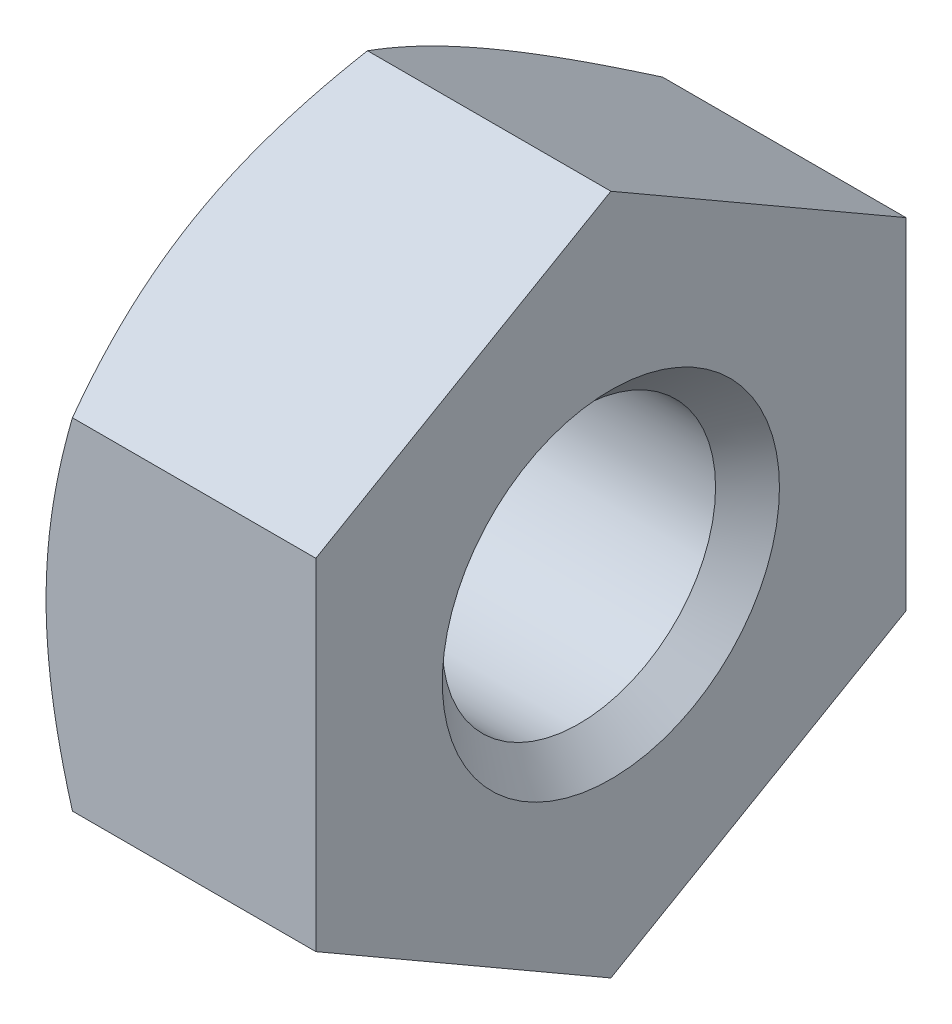
ISO-10303-21;
HEADER;
FILE_DESCRIPTION(('STEP AP214'),'2;1');
FILE_NAME('part.step','',(''),(''),'','','');
FILE_SCHEMA(('AUTOMOTIVE_DESIGN { 1 0 10303 214 1 1 1 1 }'));
ENDSEC;
DATA;
#1=APPLICATION_CONTEXT('core data for automotive mechanical design processes');
#2=APPLICATION_PROTOCOL_DEFINITION('international standard','automotive_design',2000,#1);
#3=PRODUCT_CONTEXT('',#1,'mechanical');
#4=PRODUCT('Part','Part','',(#3));
#5=PRODUCT_RELATED_PRODUCT_CATEGORY('part','',(#4));
#6=PRODUCT_DEFINITION_FORMATION('','',#4);
#7=PRODUCT_DEFINITION_CONTEXT('part definition',#1,'design');
#8=PRODUCT_DEFINITION('design','',#6,#7);
#9=PRODUCT_DEFINITION_SHAPE('','',#8);
#10=(LENGTH_UNIT() NAMED_UNIT(*) SI_UNIT(.MILLI.,.METRE.));
#11=(NAMED_UNIT(*) PLANE_ANGLE_UNIT() SI_UNIT($,.RADIAN.));
#12=(NAMED_UNIT(*) SI_UNIT($,.STERADIAN.) SOLID_ANGLE_UNIT());
#13=UNCERTAINTY_MEASURE_WITH_UNIT(LENGTH_MEASURE(1.E-05),#10,'distance_accuracy_value','');
#14=(GEOMETRIC_REPRESENTATION_CONTEXT(3) GLOBAL_UNCERTAINTY_ASSIGNED_CONTEXT((#13)) GLOBAL_UNIT_ASSIGNED_CONTEXT((#10,
#11,#12)) REPRESENTATION_CONTEXT('',''));
#15=CARTESIAN_POINT('',(0.,0.,0.));
#16=DIRECTION('',(0.,0.,1.));
#17=DIRECTION('',(1.,0.,0.));
#18=AXIS2_PLACEMENT_3D('',#15,#16,#17);
#19=CARTESIAN_POINT('',(1.6,-2.02072594216369,3.5));
#20=DIRECTION('',(0.,0.866025403784439,-0.5));
#21=DIRECTION('',(-1.,0.,0.));
#22=AXIS2_PLACEMENT_3D('',#19,#20,#21);
#23=PLANE('',#22);
#24=DIRECTION('',(-1.,0.,0.));
#25=VECTOR('',#24,1.);
#26=CARTESIAN_POINT('',(1.6,-4.04145188432738,0.));
#27=LINE('',#26,#25);
#28=CARTESIAN_POINT('',(1.6,-4.04145188432738,0.));
#29=VERTEX_POINT('',#28);
#30=CARTESIAN_POINT('',(-1.28739260883036,-4.04145188432738,0.));
#31=VERTEX_POINT('',#30);
#32=EDGE_CURVE('E10',#29,#31,#27,.T.);
#33=ORIENTED_EDGE('',*,*,#32,.F.);
#34=DIRECTION('',(0.,-0.5,-0.866025403784439));
#35=VECTOR('',#34,1.);
#36=CARTESIAN_POINT('',(1.6,-2.02072594216369,3.5));
#37=LINE('',#36,#35);
#38=CARTESIAN_POINT('',(1.6,-2.02072594216369,3.5));
#39=VERTEX_POINT('',#38);
#40=EDGE_CURVE('E308',#39,#29,#37,.T.);
#41=ORIENTED_EDGE('',*,*,#40,.F.);
#42=DIRECTION('',(-1.,0.,0.));
#43=VECTOR('',#42,1.);
#44=CARTESIAN_POINT('',(1.6,-2.02072594216369,3.5));
#45=LINE('',#44,#43);
#46=CARTESIAN_POINT('',(-1.28739260883036,-2.02072594216369,3.5));
#47=VERTEX_POINT('',#46);
#48=EDGE_CURVE('E172',#39,#47,#45,.T.);
#49=ORIENTED_EDGE('',*,*,#48,.T.);
#50=CARTESIAN_POINT('',(-1.6,-3.03108891324554,1.75000000000001));
#51=CARTESIAN_POINT('',(-1.60002957157327,-2.98866380957274,1.82342943247012));
#52=CARTESIAN_POINT('',(-1.59826342510537,-2.94622154089033,1.89684756011083));
#53=CARTESIAN_POINT('',(-1.59120796858002,-2.86156580187272,2.0433610894839));
#54=CARTESIAN_POINT('',(-1.58592893947825,-2.81935202521039,2.11645680823324));
#55=CARTESIAN_POINT('',(-1.57185336070191,-2.73479449103968,2.26310128564444));
#56=CARTESIAN_POINT('',(-1.56302605149659,-2.69245289723628,2.33664831811473));
#57=CARTESIAN_POINT('',(-1.5419161593019,-2.60711315357974,2.48483891661634));
#58=CARTESIAN_POINT('',(-1.52956839907359,-2.56411867715756,2.5594752295579));
#59=CARTESIAN_POINT('',(-1.50239590218583,-2.48005600904668,2.70509227694218));
#60=CARTESIAN_POINT('',(-1.48769793468568,-2.43898321621904,2.77609417229335));
#61=CARTESIAN_POINT('',(-1.45541959110542,-2.35655536943079,2.9186266827914));
#62=CARTESIAN_POINT('',(-1.43780242316147,-2.315204178394,2.9901511798518));
#63=CARTESIAN_POINT('',(-1.39971436888636,-2.23199323843653,3.13413905758833));
#64=CARTESIAN_POINT('',(-1.37919366198645,-2.1901397490043,3.20659279040999));
#65=CARTESIAN_POINT('',(-1.3353061551241,-2.10570692769486,3.35279662696808));
#66=CARTESIAN_POINT('',(-1.31188105391822,-2.06313558894262,3.42653388914834));
#67=CARTESIAN_POINT('',(-1.28739260883047,-2.02072594216354,3.49999999999987));
#68=B_SPLINE_CURVE_WITH_KNOTS('',3,(#50,#51,#52,#53,#54,#55,#56,#57,#58,#59,#60,#61,#62,#63,#64,
#65,#66,#67),.UNSPECIFIED.,.F.,.F.,(4,2,2,2,2,2,2,2,4),(0.,0.254391604140369,0.508041950028936,
0.763940282497238,1.02492381927395,1.27487521361346,1.52825714495415,1.78668233582199,
2.05156451629914),.UNSPECIFIED.);
#69=CARTESIAN_POINT('',(-1.6,-3.03108891324554,1.75));
#70=VERTEX_POINT('',#69);
#71=EDGE_CURVE('E163',#70,#47,#68,.T.);
#72=ORIENTED_EDGE('',*,*,#71,.F.);
#73=CARTESIAN_POINT('',(-1.28739260883058,-4.041451884327,-1.21301629162025E-13));
#74=CARTESIAN_POINT('',(-1.311881761801,-3.99903184403362,0.0734636657680727));
#75=CARTESIAN_POINT('',(-1.33530995552475,-3.95645377599351,0.147199864803283));
#76=CARTESIAN_POINT('',(-1.37920144505174,-3.87204819842292,0.293402513742193));
#77=CARTESIAN_POINT('',(-1.39972349504142,-3.83022798836153,0.365855583126786));
#78=CARTESIAN_POINT('',(-1.43781189146031,-3.74714453885451,0.509855310712891));
#79=CARTESIAN_POINT('',(-1.45542859350913,-3.70588660426272,0.581391622654936));
#80=CARTESIAN_POINT('',(-1.48770446842956,-3.62369124365301,0.723952727806153));
#81=CARTESIAN_POINT('',(-1.50240102319162,-3.58275722630122,0.794971002150564));
#82=CARTESIAN_POINT('',(-1.52957272990249,-3.49871633031337,0.940500975222592));
#83=CARTESIAN_POINT('',(-1.54192009347573,-3.45559374948824,1.01502763096098));
#84=CARTESIAN_POINT('',(-1.56302976692369,-3.36995186279489,1.16301658413272));
#85=CARTESIAN_POINT('',(-1.57185590547304,-3.32743671860256,1.23647210353567));
#86=CARTESIAN_POINT('',(-1.58593092819756,-3.24271490728029,1.38308302796878));
#87=CARTESIAN_POINT('',(-1.59120901673259,-3.20050862274593,1.45623583103307));
#88=CARTESIAN_POINT('',(-1.59826430036532,-3.11590624613429,1.60292982751019));
#89=CARTESIAN_POINT('',(-1.60002962326208,-3.07350999412018,1.67647149858659));
#90=CARTESIAN_POINT('',(-1.6,-3.03108891324554,1.75000000000001));
#91=B_SPLINE_CURVE_WITH_KNOTS('',3,(#73,#74,#75,#76,#77,#78,#79,#80,#81,#82,#83,#84,#85,#86,#87,
#88,#89,#90),.UNSPECIFIED.,.F.,.F.,(4,2,2,2,2,2,2,2,4),(0.,0.264891758241821,0.523267836488387,
0.776542750901293,1.02633037013731,1.2872217238541,1.54314190021481,1.79692889863092,
2.05157218165485),.UNSPECIFIED.);
#92=EDGE_CURVE('E129',#31,#70,#91,.T.);
#93=ORIENTED_EDGE('',*,*,#92,.F.);
#94=EDGE_LOOP('',(#33,#41,#49,#72,#93));
#95=FACE_BOUND('',#94,.T.);
#96=ADVANCED_FACE('F16',(#95),#23,.F.);
#97=CARTESIAN_POINT('',(1.6,-4.04145188432738,0.));
#98=DIRECTION('',(0.,0.866025403784439,0.5));
#99=DIRECTION('',(1.,0.,0.));
#100=AXIS2_PLACEMENT_3D('',#97,#98,#99);
#101=PLANE('',#100);
#102=DIRECTION('',(-1.,0.,0.));
#103=VECTOR('',#102,1.);
#104=CARTESIAN_POINT('',(1.6,-2.02072594216369,-3.5));
#105=LINE('',#104,#103);
#106=CARTESIAN_POINT('',(1.6,-2.02072594216369,-3.5));
#107=VERTEX_POINT('',#106);
#108=CARTESIAN_POINT('',(-1.28739260883036,-2.02072594216369,-3.5));
#109=VERTEX_POINT('',#108);
#110=EDGE_CURVE('E27',#107,#109,#105,.T.);
#111=ORIENTED_EDGE('',*,*,#110,.F.);
#112=DIRECTION('',(0.,0.5,-0.866025403784439));
#113=VECTOR('',#112,1.);
#114=CARTESIAN_POINT('',(1.6,-4.04145188432738,0.));
#115=LINE('',#114,#113);
#116=EDGE_CURVE('E304',#29,#107,#115,.T.);
#117=ORIENTED_EDGE('',*,*,#116,.F.);
#118=ORIENTED_EDGE('',*,*,#32,.T.);
#119=CARTESIAN_POINT('',(-1.6,-3.03108891324554,-1.75));
#120=CARTESIAN_POINT('',(-1.60002957157327,-3.0734681153142,-1.67654406622529));
#121=CARTESIAN_POINT('',(-1.59826342510538,-3.11582894460854,-1.60307891953086));
#122=CARTESIAN_POINT('',(-1.59120796858003,-3.20038551353537,-1.45650813427771));
#123=CARTESIAN_POINT('',(-1.58592893947827,-3.24258137454906,-1.38340207192345));
#124=CARTESIAN_POINT('',(-1.57185336070194,-3.32730045022633,-1.23685086054454));
#125=CARTESIAN_POINT('',(-1.56302605149664,-3.36982325181665,-1.16340844843916));
#126=CARTESIAN_POINT('',(-1.54191615930192,-3.45549020289232,-1.01540676323053));
#127=CARTESIAN_POINT('',(-1.52956839907358,-3.49862990773318,-0.940854297956689));
#128=CARTESIAN_POINT('',(-1.50239590218554,-3.58270663593703,-0.795245368170903));
#129=CARTESIAN_POINT('',(-1.48769793468507,-3.62365968461484,-0.724174338501541));
#130=CARTESIAN_POINT('',(-1.45541959110441,-3.705882536178,-0.581523473953656));
#131=CARTESIAN_POINT('',(-1.43780242316039,-3.74714897210693,-0.50995004350852));
#132=CARTESIAN_POINT('',(-1.39971436888529,-3.8302406620849,-0.365893316764168));
#133=CARTESIAN_POINT('',(-1.37919366198548,-3.8720606905911,-0.293420265268176));
#134=CARTESIAN_POINT('',(-1.33530615512352,-3.95646051652562,-0.147197378822947));
#135=CARTESIAN_POINT('',(-1.31188105391794,-3.99903318940255,-0.073460886901059));
#136=CARTESIAN_POINT('',(-1.28739260883047,-4.04145188432719,0.));
#137=B_SPLINE_CURVE_WITH_KNOTS('',3,(#119,#120,#121,#122,#123,#124,#125,#126,#127,#128,#129,
#130,#131,#132,#133,#134,#135,#136),.UNSPECIFIED.,.F.,.F.,(4,2,2,2,2,2,2,2,4),(0.,
0.254391604143219,0.508041950032736,0.763940282500101,1.024923819274,1.27487521361636,
1.52825714495812,1.78668233582506,2.05156451629917),.UNSPECIFIED.);
#138=CARTESIAN_POINT('',(-1.6,-3.03108891324554,-1.75));
#139=VERTEX_POINT('',#138);
#140=EDGE_CURVE('E135',#139,#31,#137,.T.);
#141=ORIENTED_EDGE('',*,*,#140,.F.);
#142=CARTESIAN_POINT('',(-1.28739260883058,-2.02072594216339,-3.49999999999974));
#143=CARTESIAN_POINT('',(-1.3118817618016,-2.0631373228281,-3.42653133459022));
#144=CARTESIAN_POINT('',(-1.33530995552598,-2.10570571035191,-3.35278954650395));
#145=CARTESIAN_POINT('',(-1.37920144505379,-2.19011812964922,-3.20659084763471));
#146=CARTESIAN_POINT('',(-1.39972349504369,-2.23195422328781,-3.13414694863699));
#147=CARTESIAN_POINT('',(-1.43781189146261,-2.3151199207615,-2.99019470693672));
#148=CARTESIAN_POINT('',(-1.45542859351127,-2.35644321689999,-2.9186961315021));
#149=CARTESIAN_POINT('',(-1.48770446843083,-2.4388070752467,-2.77623230856776));
#150=CARTESIAN_POINT('',(-1.50240102319223,-2.47984369628549,-2.70527327249189));
#151=CARTESIAN_POINT('',(-1.5295727299025,-2.56385590198499,-2.55972673507407));
#152=CARTESIAN_POINT('',(-1.54192009347568,-2.60683658870245,-2.48511815673209));
#153=CARTESIAN_POINT('',(-1.56302976692358,-2.69217783828367,-2.33695563063963));
#154=CARTESIAN_POINT('',(-1.57185590547298,-2.73453461203886,-2.26340867602139));
#155=CARTESIAN_POINT('',(-1.58593092819752,-2.81914249140874,-2.11673197294491));
#156=CARTESIAN_POINT('',(-1.59120901673257,-2.8613915349527,-2.0436038568071));
#157=CARTESIAN_POINT('',(-1.59826430036529,-2.94613107417696,-1.89698905120442));
#158=CARTESIAN_POINT('',(-1.60002962326207,-2.98862190355766,-1.82350198439841));
#159=CARTESIAN_POINT('',(-1.6,-3.03108891324554,-1.75));
#160=B_SPLINE_CURVE_WITH_KNOTS('',3,(#142,#143,#144,#145,#146,#147,#148,#149,#150,#151,#152,
#153,#154,#155,#156,#157,#158,#159),.UNSPECIFIED.,.F.,.F.,(4,2,2,2,2,2,2,2,4),(0.,
0.264891758248264,0.523267836496761,0.776542750907413,1.02633037013737,1.28722172386015,
1.54314190022287,1.79692889863695,2.05157218165483),.UNSPECIFIED.);
#161=EDGE_CURVE('E158',#109,#139,#160,.T.);
#162=ORIENTED_EDGE('',*,*,#161,.F.);
#163=EDGE_LOOP('',(#111,#117,#118,#141,#162));
#164=FACE_BOUND('',#163,.T.);
#165=ADVANCED_FACE('F518',(#164),#101,.F.);
#166=CARTESIAN_POINT('',(1.6,-2.02072594216369,-3.5));
#167=DIRECTION('',(0.,0.,1.));
#168=DIRECTION('',(1.,0.,0.));
#169=AXIS2_PLACEMENT_3D('',#166,#167,#168);
#170=PLANE('',#169);
#171=DIRECTION('',(-1.,0.,0.));
#172=VECTOR('',#171,1.);
#173=CARTESIAN_POINT('',(1.6,2.02072594216369,-3.5));
#174=LINE('',#173,#172);
#175=CARTESIAN_POINT('',(1.6,2.02072594216369,-3.5));
#176=VERTEX_POINT('',#175);
#177=CARTESIAN_POINT('',(-1.28739260883036,2.02072594216369,-3.5));
#178=VERTEX_POINT('',#177);
#179=EDGE_CURVE('E289',#176,#178,#174,.T.);
#180=ORIENTED_EDGE('',*,*,#179,.F.);
#181=DIRECTION('',(0.,1.,0.));
#182=VECTOR('',#181,1.);
#183=CARTESIAN_POINT('',(1.6,-2.02072594216369,-3.5));
#184=LINE('',#183,#182);
#185=EDGE_CURVE('E300',#107,#176,#184,.T.);
#186=ORIENTED_EDGE('',*,*,#185,.F.);
#187=ORIENTED_EDGE('',*,*,#110,.T.);
#188=CARTESIAN_POINT('',(-1.6,0.,-3.5));
#189=CARTESIAN_POINT('',(-1.60002985945304,-0.0850895445468611,-3.49997330807448));
#190=CARTESIAN_POINT('',(-1.59825603889534,-0.170178056856382,-3.49991852167455));
#191=CARTESIAN_POINT('',(-1.59116711521132,-0.339923824420759,-3.4998391138121));
#192=CARTESIAN_POINT('',(-1.5858638274263,-0.424581572101538,-3.49981439248102));
#193=CARTESIAN_POINT('',(-1.57172169737839,-0.594323012203998,-3.49988042440541));
#194=CARTESIAN_POINT('',(-1.56285321646093,-0.679404217565962,-3.49997215995854));
#195=CARTESIAN_POINT('',(-1.54164335661952,-0.850818568447764,-3.50014344890988));
#196=CARTESIAN_POINT('',(-1.52923745376652,-0.937143658980966,-3.50022272899293));
#197=CARTESIAN_POINT('',(-1.50200677589762,-1.10519935721461,-3.50023410680411));
#198=CARTESIAN_POINT('',(-1.48732501833766,-1.18695330123284,-3.50017302187236));
#199=CARTESIAN_POINT('',(-1.45509108540878,-1.35108654695151,-3.50007560756531));
#200=CARTESIAN_POINT('',(-1.43750144498095,-1.43345847341397,-3.5000396384291));
#201=CARTESIAN_POINT('',(-1.399480004769,-1.599293245139,-3.49999599501919));
#202=CARTESIAN_POINT('',(-1.37899794775457,-1.6827444918892,-3.49998890729803));
#203=CARTESIAN_POINT('',(-1.33519894620792,-1.85115371236418,-3.49998822891513));
#204=CARTESIAN_POINT('',(-1.31182346182259,-1.93609649918093,-3.49999498370794));
#205=CARTESIAN_POINT('',(-1.28739260883036,-2.02072594216368,-3.5));
#206=B_SPLINE_CURVE_WITH_KNOTS('',3,(#188,#189,#190,#191,#192,#193,#194,#195,#196,#197,#198,
#199,#200,#201,#202,#203,#204,#205),.UNSPECIFIED.,.F.,.F.,(4,2,2,2,2,2,2,2,4),(0.,
0.255247470218691,0.50964473643535,0.766202135105267,1.02777673514438,1.2769170751132,
1.52956127384764,1.78731159849954,2.05157262925042),.UNSPECIFIED.);
#207=CARTESIAN_POINT('',(-1.6,0.,-3.5));
#208=VERTEX_POINT('',#207);
#209=EDGE_CURVE('E583',#208,#109,#206,.T.);
#210=ORIENTED_EDGE('',*,*,#209,.F.);
#211=CARTESIAN_POINT('',(-1.28739260883036,2.02072594216369,-3.49999999999999));
#212=CARTESIAN_POINT('',(-1.31182815312882,1.93608005208965,-3.49999507400937));
#213=CARTESIAN_POINT('',(-1.33520833735885,1.85112080636164,-3.49998754450913));
#214=CARTESIAN_POINT('',(-1.37901586685387,1.68268058395045,-3.49998547850255));
#215=CARTESIAN_POINT('',(-1.39950180444946,1.59921480791501,-3.49999062621565));
#216=CARTESIAN_POINT('',(-1.43753001486371,1.43335271755952,-3.50002972849625));
#217=CARTESIAN_POINT('',(-1.45512260330846,1.35096801530384,-3.50006310982116));
#218=CARTESIAN_POINT('',(-1.4873620573321,1.18681087544078,-3.50015382191118));
#219=CARTESIAN_POINT('',(-1.50204643766767,1.10504582324741,-3.50021081365072));
#220=CARTESIAN_POINT('',(-1.5292723255425,0.937014148382917,-3.50019409116989));
#221=CARTESIAN_POINT('',(-1.54167238098583,0.850724444732006,-3.5001137901398));
#222=CARTESIAN_POINT('',(-1.5628722479012,0.679366055228478,-3.49994553159757));
#223=CARTESIAN_POINT('',(-1.57173604046913,0.594305355427493,-3.49985774872827));
#224=CARTESIAN_POINT('',(-1.58587122993843,0.424590795407029,-3.49980023251352));
#225=CARTESIAN_POINT('',(-1.59117167108804,0.339939371177556,-3.49982953088654));
#226=CARTESIAN_POINT('',(-1.59825718328842,0.17019262960869,-3.49991601190796));
#227=CARTESIAN_POINT('',(-1.60002986932775,0.0850967963066711,-3.4999732919193));
#228=CARTESIAN_POINT('',(-1.6,0.,-3.5));
#229=B_SPLINE_CURVE_WITH_KNOTS('',3,(#211,#212,#213,#214,#215,#216,#217,#218,#219,#220,#221,
#222,#223,#224,#225,#226,#227,#228),.UNSPECIFIED.,.F.,.F.,(4,2,2,2,2,2,2,2,4),(0.,
0.264312364874812,0.5221077889018,0.774791321242292,1.02396581554141,1.28543281551271,
1.54192752342708,1.79630538516716,2.05157473556663),.UNSPECIFIED.);
#230=EDGE_CURVE('E613',#178,#208,#229,.T.);
#231=ORIENTED_EDGE('',*,*,#230,.F.);
#232=EDGE_LOOP('',(#180,#186,#187,#210,#231));
#233=FACE_BOUND('',#232,.T.);
#234=ADVANCED_FACE('F494',(#233),#170,.F.);
#235=CARTESIAN_POINT('',(1.6,2.02072594216369,-3.5));
#236=DIRECTION('',(0.,-0.866025403784439,0.5));
#237=DIRECTION('',(-1.,0.,0.));
#238=AXIS2_PLACEMENT_3D('',#235,#236,#237);
#239=PLANE('',#238);
#240=DIRECTION('',(-1.,0.,0.));
#241=VECTOR('',#240,1.);
#242=CARTESIAN_POINT('',(1.6,4.04145188432738,0.));
#243=LINE('',#242,#241);
#244=CARTESIAN_POINT('',(1.6,4.04145188432738,0.));
#245=VERTEX_POINT('',#244);
#246=CARTESIAN_POINT('',(-1.28739260883036,4.04145188432738,0.));
#247=VERTEX_POINT('',#246);
#248=EDGE_CURVE('E281',#245,#247,#243,.T.);
#249=ORIENTED_EDGE('',*,*,#248,.F.);
#250=DIRECTION('',(0.,0.5,0.866025403784439));
#251=VECTOR('',#250,1.);
#252=CARTESIAN_POINT('',(1.6,2.02072594216369,-3.5));
#253=LINE('',#252,#251);
#254=EDGE_CURVE('E297',#176,#245,#253,.T.);
#255=ORIENTED_EDGE('',*,*,#254,.F.);
#256=ORIENTED_EDGE('',*,*,#179,.T.);
#257=CARTESIAN_POINT('',(-1.6,3.03108891324554,-1.74999999999999));
#258=CARTESIAN_POINT('',(-1.60002957157327,2.98866380957255,-1.82342943247043));
#259=CARTESIAN_POINT('',(-1.59826342510537,2.94622154088993,-1.89684756011145));
#260=CARTESIAN_POINT('',(-1.59120796858002,2.86156580187199,-2.04336108948492));
#261=CARTESIAN_POINT('',(-1.58592893947825,2.81935202520955,-2.11645680823434));
#262=CARTESIAN_POINT('',(-1.57185336070192,2.73479449103877,-2.2631012856455));
#263=CARTESIAN_POINT('',(-1.56302605149661,2.69245289723541,-2.33664831811567));
#264=CARTESIAN_POINT('',(-1.54191615930191,2.60711315357919,-2.48483891661688));
#265=CARTESIAN_POINT('',(-1.52956839907359,2.56411867715729,-2.55947522955817));
#266=CARTESIAN_POINT('',(-1.50239590218572,2.48005600904658,-2.70509227694254));
#267=CARTESIAN_POINT('',(-1.48769793468544,2.43898321621885,-2.77609417229407));
#268=CARTESIAN_POINT('',(-1.45541959110502,2.35655536943042,-2.9186266827926));
#269=CARTESIAN_POINT('',(-1.43780242316104,2.31520417839354,-2.9901511798531));
#270=CARTESIAN_POINT('',(-1.39971436888594,2.231993238436,-3.13413905758961));
#271=CARTESIAN_POINT('',(-1.37919366198606,2.19013974900377,-3.20659279041115));
#272=CARTESIAN_POINT('',(-1.33530615512387,2.10570692769451,-3.35279662696876));
#273=CARTESIAN_POINT('',(-1.31188105391811,2.06313558894243,-3.42653388914867));
#274=CARTESIAN_POINT('',(-1.28739260883047,2.02072594216354,-3.49999999999987));
#275=B_SPLINE_CURVE_WITH_KNOTS('',3,(#257,#258,#259,#260,#261,#262,#263,#264,#265,#266,#267,
#268,#269,#270,#271,#272,#273,#274),.UNSPECIFIED.,.F.,.F.,(4,2,2,2,2,2,2,2,4),(0.,
0.2543916041415,0.508041950030443,0.763940282498374,1.02492381927397,1.27487521361461,
1.52825714495573,1.78668233582321,2.05156451629916),.UNSPECIFIED.);
#276=CARTESIAN_POINT('',(-1.6,3.03108891324554,-1.75));
#277=VERTEX_POINT('',#276);
#278=EDGE_CURVE('E606',#277,#178,#275,.T.);
#279=ORIENTED_EDGE('',*,*,#278,.F.);
#280=CARTESIAN_POINT('',(-1.28739260883058,4.041451884327,1.14617503577598E-13));
#281=CARTESIAN_POINT('',(-1.3118817618012,3.99903184403327,-0.0734636657686821));
#282=CARTESIAN_POINT('',(-1.33530995552516,3.95645377599276,-0.147199864804463));
#283=CARTESIAN_POINT('',(-1.37920144505244,3.87204819842157,-0.293402513744078));
#284=CARTESIAN_POINT('',(-1.39972349504219,3.83022798836,-0.365855583128802));
#285=CARTESIAN_POINT('',(-1.43781189146109,3.74714453885288,-0.509855310714805));
#286=CARTESIAN_POINT('',(-1.45542859350985,3.70588660426118,-0.581391622656612));
#287=CARTESIAN_POINT('',(-1.48770446842999,3.62369124365204,-0.723952727807118));
#288=CARTESIAN_POINT('',(-1.50240102319183,3.58275722630073,-0.794971002151052));
#289=CARTESIAN_POINT('',(-1.52957272990249,3.49871633031319,-0.940500975223287));
#290=CARTESIAN_POINT('',(-1.54192009347571,3.45559374948788,-1.01502763096236));
#291=CARTESIAN_POINT('',(-1.56302976692365,3.36995186279419,-1.16301658413496));
#292=CARTESIAN_POINT('',(-1.57185590547302,3.32743671860171,-1.23647210353808));
#293=CARTESIAN_POINT('',(-1.58593092819755,3.24271490727932,-1.38308302797112));
#294=CARTESIAN_POINT('',(-1.59120901673259,3.20050862274499,-1.45623583103516));
#295=CARTESIAN_POINT('',(-1.59826430036531,3.11590624613367,-1.6029298275114));
#296=CARTESIAN_POINT('',(-1.60002962326207,3.07350999411985,-1.67647149858717));
#297=CARTESIAN_POINT('',(-1.6,3.03108891324554,-1.74999999999999));
#298=B_SPLINE_CURVE_WITH_KNOTS('',3,(#280,#281,#282,#283,#284,#285,#286,#287,#288,#289,#290,
#291,#292,#293,#294,#295,#296,#297),.UNSPECIFIED.,.F.,.F.,(4,2,2,2,2,2,2,2,4),(0.,
0.264891758244007,0.523267836491225,0.776542750903365,1.02633037013732,1.28722172385615,
1.54314190021754,1.79692889863295,2.05157218165483),.UNSPECIFIED.);
#299=EDGE_CURVE('E651',#247,#277,#298,.T.);
#300=ORIENTED_EDGE('',*,*,#299,.F.);
#301=EDGE_LOOP('',(#249,#255,#256,#279,#300));
#302=FACE_BOUND('',#301,.T.);
#303=ADVANCED_FACE('F219',(#302),#239,.F.);
#304=CARTESIAN_POINT('',(1.6,4.04145188432738,0.));
#305=DIRECTION('',(0.,-0.866025403784439,-0.5));
#306=DIRECTION('',(0.,0.5,-0.866025403784439));
#307=AXIS2_PLACEMENT_3D('',#304,#305,#306);
#308=PLANE('',#307);
#309=DIRECTION('',(-1.,0.,0.));
#310=VECTOR('',#309,1.);
#311=CARTESIAN_POINT('',(1.6,2.02072594216369,3.5));
#312=LINE('',#311,#310);
#313=CARTESIAN_POINT('',(1.6,2.02072594216369,3.5));
#314=VERTEX_POINT('',#313);
#315=CARTESIAN_POINT('',(-1.28739260883036,2.02072594216369,3.5));
#316=VERTEX_POINT('',#315);
#317=EDGE_CURVE('E274',#314,#316,#312,.T.);
#318=ORIENTED_EDGE('',*,*,#317,.F.);
#319=DIRECTION('',(0.,-0.5,0.866025403784439));
#320=VECTOR('',#319,1.);
#321=CARTESIAN_POINT('',(1.6,4.04145188432738,0.));
#322=LINE('',#321,#320);
#323=EDGE_CURVE('E316',#245,#314,#322,.T.);
#324=ORIENTED_EDGE('',*,*,#323,.F.);
#325=ORIENTED_EDGE('',*,*,#248,.T.);
#326=CARTESIAN_POINT('',(-1.6,3.03108891324554,1.75));
#327=CARTESIAN_POINT('',(-1.60002957157327,3.07346811531408,1.6765440662255));
#328=CARTESIAN_POINT('',(-1.59826342510538,3.11582894460831,1.6030789195313));
#329=CARTESIAN_POINT('',(-1.59120796858003,3.20038551353503,1.45650813427847));
#330=CARTESIAN_POINT('',(-1.58592893947826,3.24258137454871,1.3834020719243));
#331=CARTESIAN_POINT('',(-1.57185336070193,3.32730045022602,1.23685086054542));
#332=CARTESIAN_POINT('',(-1.56302605149663,3.36982325181639,1.16340844843998));
#333=CARTESIAN_POINT('',(-1.54191615930191,3.45549020289219,1.01540676323104));
#334=CARTESIAN_POINT('',(-1.52956839907359,3.49862990773311,0.94085429795695));
#335=CARTESIAN_POINT('',(-1.50239590218562,3.58270663593685,0.795245368171092));
#336=CARTESIAN_POINT('',(-1.48769793468523,3.62365968461449,0.724174338501905));
#337=CARTESIAN_POINT('',(-1.45541959110468,3.70588253617743,0.581523473954279));
#338=CARTESIAN_POINT('',(-1.43780242316067,3.74714897210633,0.509950043509231));
#339=CARTESIAN_POINT('',(-1.39971436888557,3.83024066208434,0.365893316764918));
#340=CARTESIAN_POINT('',(-1.37919366198573,3.8720606905906,0.29342026526888));
#341=CARTESIAN_POINT('',(-1.33530615512367,3.95646051652534,0.147197378823393));
#342=CARTESIAN_POINT('',(-1.31188105391801,3.99903318940242,0.0734608869012944));
#343=CARTESIAN_POINT('',(-1.28739260883047,4.04145188432719,0.));
#344=B_SPLINE_CURVE_WITH_KNOTS('',3,(#326,#327,#328,#329,#330,#331,#332,#333,#334,#335,#336,
#337,#338,#339,#340,#341,#342,#343),.UNSPECIFIED.,.F.,.F.,(4,2,2,2,2,2,2,2,4),(0.,
0.25439160414247,0.508041950031735,0.763940282499341,1.02492381927397,1.27487521361558,
1.52825714495706,1.78668233582423,2.05156451629915),.UNSPECIFIED.);
#345=CARTESIAN_POINT('',(-1.6,3.03108891324554,1.75));
#346=VERTEX_POINT('',#345);
#347=EDGE_CURVE('E607',#346,#247,#344,.T.);
#348=ORIENTED_EDGE('',*,*,#347,.F.);
#349=CARTESIAN_POINT('',(-1.28739260883058,2.02072594216339,3.49999999999973));
#350=CARTESIAN_POINT('',(-1.3118817618014,2.06313732282776,3.42653133459083));
#351=CARTESIAN_POINT('',(-1.33530995552556,2.10570571035128,3.35278954650519));
#352=CARTESIAN_POINT('',(-1.3792014450531,2.19011812964827,3.20659084763682));
#353=CARTESIAN_POINT('',(-1.39972349504292,2.23195422328683,3.13414694863932));
#354=CARTESIAN_POINT('',(-1.43781189146183,2.31511992076067,2.99019470693908));
#355=CARTESIAN_POINT('',(-1.45542859351054,2.35644321689931,2.91869613150427));
#356=CARTESIAN_POINT('',(-1.4877044684304,2.43880707524636,2.77623230856908));
#357=CARTESIAN_POINT('',(-1.50240102319203,2.47984369628532,2.70527327249255));
#358=CARTESIAN_POINT('',(-1.5295727299025,2.56385590198448,2.55972673507457));
#359=CARTESIAN_POINT('',(-1.5419200934757,2.60683658870144,2.48511815673309));
#360=CARTESIAN_POINT('',(-1.56302976692362,2.69217783828208,2.33695563064135));
#361=CARTESIAN_POINT('',(-1.571855905473,2.73453461203719,2.26340867602334));
#362=CARTESIAN_POINT('',(-1.58593092819753,2.81914249140721,2.11673197294692));
#363=CARTESIAN_POINT('',(-1.59120901673258,2.86139153495136,2.04360385680897));
#364=CARTESIAN_POINT('',(-1.5982643003653,2.94613107417622,1.89698905120557));
#365=CARTESIAN_POINT('',(-1.60002962326207,2.98862190355732,1.823501984399));
#366=CARTESIAN_POINT('',(-1.6,3.03108891324554,1.75));
#367=B_SPLINE_CURVE_WITH_KNOTS('',3,(#349,#350,#351,#352,#353,#354,#355,#356,#357,#358,#359,
#360,#361,#362,#363,#364,#365,#366),.UNSPECIFIED.,.F.,.F.,(4,2,2,2,2,2,2,2,4),(0.,
0.264891758246078,0.52326783649392,0.776542750905337,1.02633037013736,1.2872217238581,
1.54314190022013,1.7969288986349,2.05157218165484),.UNSPECIFIED.);
#368=EDGE_CURVE('E270',#316,#346,#367,.T.);
#369=ORIENTED_EDGE('',*,*,#368,.F.);
#370=EDGE_LOOP('',(#318,#324,#325,#348,#369));
#371=FACE_BOUND('',#370,.T.);
#372=ADVANCED_FACE('F218',(#371),#308,.F.);
#373=CARTESIAN_POINT('',(1.6,2.02072594216369,3.5));
#374=DIRECTION('',(0.,0.,-1.));
#375=DIRECTION('',(0.,-1.,0.));
#376=AXIS2_PLACEMENT_3D('',#373,#374,#375);
#377=PLANE('',#376);
#378=ORIENTED_EDGE('',*,*,#48,.F.);
#379=DIRECTION('',(0.,-1.,0.));
#380=VECTOR('',#379,1.);
#381=CARTESIAN_POINT('',(1.6,2.02072594216369,3.5));
#382=LINE('',#381,#380);
#383=EDGE_CURVE('E312',#314,#39,#382,.T.);
#384=ORIENTED_EDGE('',*,*,#383,.F.);
#385=ORIENTED_EDGE('',*,*,#317,.T.);
#386=CARTESIAN_POINT('',(-1.6,0.,3.5));
#387=CARTESIAN_POINT('',(-1.60002985945304,0.0850895445468679,3.49997330807448));
#388=CARTESIAN_POINT('',(-1.59825603889534,0.170178056856388,3.49991852167455));
#389=CARTESIAN_POINT('',(-1.59116711521132,0.339923824420764,3.4998391138121));
#390=CARTESIAN_POINT('',(-1.5858638274263,0.424581572101541,3.49981439248102));
#391=CARTESIAN_POINT('',(-1.57172169737839,0.594323012203997,3.49988042440541));
#392=CARTESIAN_POINT('',(-1.56285321646093,0.679404217565958,3.49997215995855));
#393=CARTESIAN_POINT('',(-1.54164335661952,0.850818568447756,3.50014344890988));
#394=CARTESIAN_POINT('',(-1.52923745376652,0.937143658980956,3.50022272899294));
#395=CARTESIAN_POINT('',(-1.50200677589762,1.1051993572146,3.50023410680411));
#396=CARTESIAN_POINT('',(-1.48732501833766,1.18695330123284,3.50017302187236));
#397=CARTESIAN_POINT('',(-1.45509108540878,1.35108654695151,3.50007560756531));
#398=CARTESIAN_POINT('',(-1.43750144498095,1.43345847341397,3.5000396384291));
#399=CARTESIAN_POINT('',(-1.399480004769,1.59929324513901,3.49999599501919));
#400=CARTESIAN_POINT('',(-1.37899794775457,1.6827444918892,3.49998890729803));
#401=CARTESIAN_POINT('',(-1.33519894620792,1.85115371236419,3.49998822891513));
#402=CARTESIAN_POINT('',(-1.31182346182259,1.93609649918094,3.49999498370794));
#403=CARTESIAN_POINT('',(-1.28739260883036,2.02072594216369,3.5));
#404=B_SPLINE_CURVE_WITH_KNOTS('',3,(#386,#387,#388,#389,#390,#391,#392,#393,#394,#395,#396,
#397,#398,#399,#400,#401,#402,#403),.UNSPECIFIED.,.F.,.F.,(4,2,2,2,2,2,2,2,4),(0.,
0.25524747021869,0.509644736435344,0.766202135105253,1.02777673514436,1.27691707511319,
1.52956127384763,1.78731159849954,2.05157262925041),.UNSPECIFIED.);
#405=CARTESIAN_POINT('',(-1.6,0.,3.5));
#406=VERTEX_POINT('',#405);
#407=EDGE_CURVE('E235',#406,#316,#404,.T.);
#408=ORIENTED_EDGE('',*,*,#407,.F.);
#409=CARTESIAN_POINT('',(-1.28739260883036,-2.0207259421637,3.49999999999999));
#410=CARTESIAN_POINT('',(-1.31182815312882,-1.93608005208966,3.49999507400937));
#411=CARTESIAN_POINT('',(-1.33520833735885,-1.85112080636164,3.49998754450913));
#412=CARTESIAN_POINT('',(-1.37901586685387,-1.68268058395045,3.49998547850255));
#413=CARTESIAN_POINT('',(-1.39950180444946,-1.59921480791501,3.49999062621565));
#414=CARTESIAN_POINT('',(-1.43753001486371,-1.43335271755952,3.50002972849625));
#415=CARTESIAN_POINT('',(-1.45512260330846,-1.35096801530384,3.50006310982116));
#416=CARTESIAN_POINT('',(-1.4873620573321,-1.18681087544078,3.50015382191118));
#417=CARTESIAN_POINT('',(-1.50204643766767,-1.10504582324742,3.50021081365071));
#418=CARTESIAN_POINT('',(-1.5292723255425,-0.937014148382923,3.50019409116989));
#419=CARTESIAN_POINT('',(-1.54167238098583,-0.850724444732011,3.5001137901398));
#420=CARTESIAN_POINT('',(-1.5628722479012,-0.679366055228481,3.49994553159757));
#421=CARTESIAN_POINT('',(-1.57173604046913,-0.594305355427497,3.49985774872827));
#422=CARTESIAN_POINT('',(-1.58587122993843,-0.424590795407033,3.49980023251352));
#423=CARTESIAN_POINT('',(-1.59117167108804,-0.33993937117756,3.49982953088654));
#424=CARTESIAN_POINT('',(-1.59825718328842,-0.170192629608695,3.49991601190796));
#425=CARTESIAN_POINT('',(-1.60002986932775,-0.0850967963066775,3.49997329191931));
#426=CARTESIAN_POINT('',(-1.6,0.,3.5));
#427=B_SPLINE_CURVE_WITH_KNOTS('',3,(#409,#410,#411,#412,#413,#414,#415,#416,#417,#418,#419,
#420,#421,#422,#423,#424,#425,#426),.UNSPECIFIED.,.F.,.F.,(4,2,2,2,2,2,2,2,4),(0.,
0.264312364874815,0.522107788901803,0.774791321242293,1.0239658155414,1.28543281551271,
1.54192752342708,1.79630538516716,2.05157473556662),.UNSPECIFIED.);
#428=EDGE_CURVE('E166',#47,#406,#427,.T.);
#429=ORIENTED_EDGE('',*,*,#428,.F.);
#430=EDGE_LOOP('',(#378,#384,#385,#408,#429));
#431=FACE_BOUND('',#430,.T.);
#432=ADVANCED_FACE('F207',(#431),#377,.F.);
#433=CARTESIAN_POINT('',(1.221,0.,0.));
#434=DIRECTION('',(1.,0.,0.));
#435=DIRECTION('',(0.,0.,-1.));
#436=AXIS2_PLACEMENT_3D('',#433,#434,#435);
#437=CONICAL_SURFACE('',#436,1.621,0.785398163397448);
#438=CARTESIAN_POINT('',(1.221,0.,0.));
#439=DIRECTION('',(1.,0.,0.));
#440=DIRECTION('',(0.,0.,-1.));
#441=AXIS2_PLACEMENT_3D('',#438,#439,#440);
#442=CIRCLE('',#441,1.621);
#443=CARTESIAN_POINT('',(1.221,0.,-1.621));
#444=VERTEX_POINT('',#443);
#445=EDGE_CURVE('E38',#444,#444,#442,.T.);
#446=ORIENTED_EDGE('',*,*,#445,.F.);
#447=EDGE_LOOP('',(#446));
#448=FACE_BOUND('',#447,.T.);
#449=CARTESIAN_POINT('',(1.6,0.,0.));
#450=DIRECTION('',(1.,0.,0.));
#451=DIRECTION('',(0.,0.,-1.));
#452=AXIS2_PLACEMENT_3D('',#449,#450,#451);
#453=CIRCLE('',#452,2.);
#454=CARTESIAN_POINT('',(1.6,0.,-2.));
#455=VERTEX_POINT('',#454);
#456=EDGE_CURVE('E141',#455,#455,#453,.T.);
#457=ORIENTED_EDGE('',*,*,#456,.T.);
#458=EDGE_LOOP('',(#457));
#459=FACE_BOUND('',#458,.T.);
#460=ADVANCED_FACE('F217',(#448,#459),#437,.F.);
#461=CARTESIAN_POINT('',(1.6,0.,0.));
#462=DIRECTION('',(1.,0.,0.));
#463=DIRECTION('',(0.,0.,-1.));
#464=AXIS2_PLACEMENT_3D('',#461,#462,#463);
#465=CYLINDRICAL_SURFACE('',#464,1.621);
#466=CARTESIAN_POINT('',(-1.221,0.,0.));
#467=DIRECTION('',(1.,0.,0.));
#468=DIRECTION('',(0.,0.,-1.));
#469=AXIS2_PLACEMENT_3D('',#466,#467,#468);
#470=CIRCLE('',#469,1.621);
#471=CARTESIAN_POINT('',(-1.221,0.,-1.621));
#472=VERTEX_POINT('',#471);
#473=EDGE_CURVE('E45',#472,#472,#470,.T.);
#474=ORIENTED_EDGE('',*,*,#473,.F.);
#475=EDGE_LOOP('',(#474));
#476=FACE_BOUND('',#475,.T.);
#477=ORIENTED_EDGE('',*,*,#445,.T.);
#478=EDGE_LOOP('',(#477));
#479=FACE_BOUND('',#478,.T.);
#480=ADVANCED_FACE('F188',(#476,#479),#465,.F.);
#481=CARTESIAN_POINT('',(-1.6,0.,0.));
#482=DIRECTION('',(-1.,0.,0.));
#483=DIRECTION('',(0.,0.,1.));
#484=AXIS2_PLACEMENT_3D('',#481,#482,#483);
#485=CONICAL_SURFACE('',#484,2.,0.785398163397448);
#486=CARTESIAN_POINT('',(-1.6,0.,0.));
#487=DIRECTION('',(1.,0.,0.));
#488=DIRECTION('',(0.,0.,-1.));
#489=AXIS2_PLACEMENT_3D('',#486,#487,#488);
#490=CIRCLE('',#489,2.);
#491=CARTESIAN_POINT('',(-1.6,0.,-2.));
#492=VERTEX_POINT('',#491);
#493=EDGE_CURVE('E157',#492,#492,#490,.T.);
#494=ORIENTED_EDGE('',*,*,#493,.F.);
#495=EDGE_LOOP('',(#494));
#496=FACE_BOUND('',#495,.T.);
#497=ORIENTED_EDGE('',*,*,#473,.T.);
#498=EDGE_LOOP('',(#497));
#499=FACE_BOUND('',#498,.T.);
#500=ADVANCED_FACE('F400',(#496,#499),#485,.F.);
#501=CARTESIAN_POINT('',(1.6,4.05,0.));
#502=DIRECTION('',(-1.,0.,0.));
#503=DIRECTION('',(0.,0.,1.));
#504=AXIS2_PLACEMENT_3D('',#501,#502,#503);
#505=PLANE('',#504);
#506=ORIENTED_EDGE('',*,*,#323,.T.);
#507=ORIENTED_EDGE('',*,*,#383,.T.);
#508=ORIENTED_EDGE('',*,*,#40,.T.);
#509=ORIENTED_EDGE('',*,*,#116,.T.);
#510=ORIENTED_EDGE('',*,*,#185,.T.);
#511=ORIENTED_EDGE('',*,*,#254,.T.);
#512=EDGE_LOOP('',(#506,#507,#508,#509,#510,#511));
#513=FACE_BOUND('',#512,.T.);
#514=ORIENTED_EDGE('',*,*,#456,.F.);
#515=EDGE_LOOP('',(#514));
#516=FACE_BOUND('',#515,.T.);
#517=ADVANCED_FACE('F453',(#513,#516),#505,.F.);
#518=CARTESIAN_POINT('',(-1.6,0.,0.));
#519=DIRECTION('',(1.,0.,0.));
#520=DIRECTION('',(0.,0.,-1.));
#521=AXIS2_PLACEMENT_3D('',#518,#519,#520);
#522=CONICAL_SURFACE('',#521,3.5,1.0471975511966);
#523=CARTESIAN_POINT('',(-1.6,0.,0.));
#524=DIRECTION('',(1.,0.,0.));
#525=DIRECTION('',(0.,0.,-1.));
#526=AXIS2_PLACEMENT_3D('',#523,#524,#525);
#527=CIRCLE('',#526,3.5);
#528=EDGE_CURVE('E133',#70,#139,#527,.T.);
#529=ORIENTED_EDGE('',*,*,#528,.T.);
#530=ORIENTED_EDGE('',*,*,#140,.T.);
#531=ORIENTED_EDGE('',*,*,#92,.T.);
#532=EDGE_LOOP('',(#529,#530,#531));
#533=FACE_BOUND('',#532,.T.);
#534=ADVANCED_FACE('F132',(#533),#522,.T.);
#535=CARTESIAN_POINT('',(-1.6,0.,0.));
#536=DIRECTION('',(1.,0.,0.));
#537=DIRECTION('',(0.,1.,0.));
#538=AXIS2_PLACEMENT_3D('',#535,#536,#537);
#539=PLANE('',#538);
#540=ORIENTED_EDGE('',*,*,#493,.T.);
#541=EDGE_LOOP('',(#540));
#542=FACE_BOUND('',#541,.T.);
#543=CARTESIAN_POINT('',(-1.6,0.,0.));
#544=DIRECTION('',(1.,0.,0.));
#545=DIRECTION('',(0.,0.,-1.));
#546=AXIS2_PLACEMENT_3D('',#543,#544,#545);
#547=CIRCLE('',#546,3.5);
#548=EDGE_CURVE('E642',#277,#346,#547,.T.);
#549=ORIENTED_EDGE('',*,*,#548,.F.);
#550=CARTESIAN_POINT('',(-1.6,0.,0.));
#551=DIRECTION('',(1.,0.,0.));
#552=DIRECTION('',(0.,0.,-1.));
#553=AXIS2_PLACEMENT_3D('',#550,#551,#552);
#554=CIRCLE('',#553,3.5);
#555=EDGE_CURVE('E597',#208,#277,#554,.T.);
#556=ORIENTED_EDGE('',*,*,#555,.F.);
#557=CARTESIAN_POINT('',(-1.6,0.,0.));
#558=DIRECTION('',(1.,0.,0.));
#559=DIRECTION('',(0.,0.,-1.));
#560=AXIS2_PLACEMENT_3D('',#557,#558,#559);
#561=CIRCLE('',#560,3.5);
#562=EDGE_CURVE('E155',#139,#208,#561,.T.);
#563=ORIENTED_EDGE('',*,*,#562,.F.);
#564=ORIENTED_EDGE('',*,*,#528,.F.);
#565=CARTESIAN_POINT('',(-1.6,0.,0.));
#566=DIRECTION('',(1.,0.,0.));
#567=DIRECTION('',(0.,0.,-1.));
#568=AXIS2_PLACEMENT_3D('',#565,#566,#567);
#569=CIRCLE('',#568,3.5);
#570=EDGE_CURVE('E151',#406,#70,#569,.T.);
#571=ORIENTED_EDGE('',*,*,#570,.F.);
#572=CARTESIAN_POINT('',(-1.6,0.,0.));
#573=DIRECTION('',(1.,0.,0.));
#574=DIRECTION('',(0.,0.,-1.));
#575=AXIS2_PLACEMENT_3D('',#572,#573,#574);
#576=CIRCLE('',#575,3.5);
#577=EDGE_CURVE('E169',#346,#406,#576,.T.);
#578=ORIENTED_EDGE('',*,*,#577,.F.);
#579=EDGE_LOOP('',(#549,#556,#563,#564,#571,#578));
#580=FACE_BOUND('',#579,.T.);
#581=ADVANCED_FACE('F149',(#542,#580),#539,.F.);
#582=CARTESIAN_POINT('',(-1.6,0.,0.));
#583=DIRECTION('',(1.,0.,0.));
#584=DIRECTION('',(0.,0.,-1.));
#585=AXIS2_PLACEMENT_3D('',#582,#583,#584);
#586=CONICAL_SURFACE('',#585,3.5,1.0471975511966);
#587=ORIENTED_EDGE('',*,*,#562,.T.);
#588=ORIENTED_EDGE('',*,*,#209,.T.);
#589=ORIENTED_EDGE('',*,*,#161,.T.);
#590=EDGE_LOOP('',(#587,#588,#589));
#591=FACE_BOUND('',#590,.T.);
#592=ADVANCED_FACE('F251',(#591),#586,.T.);
#593=CARTESIAN_POINT('',(-1.6,0.,0.));
#594=DIRECTION('',(1.,0.,0.));
#595=DIRECTION('',(0.,0.,-1.));
#596=AXIS2_PLACEMENT_3D('',#593,#594,#595);
#597=CONICAL_SURFACE('',#596,3.5,1.0471975511966);
#598=ORIENTED_EDGE('',*,*,#555,.T.);
#599=ORIENTED_EDGE('',*,*,#278,.T.);
#600=ORIENTED_EDGE('',*,*,#230,.T.);
#601=EDGE_LOOP('',(#598,#599,#600));
#602=FACE_BOUND('',#601,.T.);
#603=ADVANCED_FACE('F419',(#602),#597,.T.);
#604=CARTESIAN_POINT('',(-1.6,0.,0.));
#605=DIRECTION('',(1.,0.,0.));
#606=DIRECTION('',(0.,0.,-1.));
#607=AXIS2_PLACEMENT_3D('',#604,#605,#606);
#608=CONICAL_SURFACE('',#607,3.5,1.0471975511966);
#609=ORIENTED_EDGE('',*,*,#299,.T.);
#610=ORIENTED_EDGE('',*,*,#548,.T.);
#611=ORIENTED_EDGE('',*,*,#347,.T.);
#612=EDGE_LOOP('',(#609,#610,#611));
#613=FACE_BOUND('',#612,.T.);
#614=ADVANCED_FACE('F249',(#613),#608,.T.);
#615=CARTESIAN_POINT('',(-1.6,0.,0.));
#616=DIRECTION('',(1.,0.,0.));
#617=DIRECTION('',(0.,0.,-1.));
#618=AXIS2_PLACEMENT_3D('',#615,#616,#617);
#619=CONICAL_SURFACE('',#618,3.5,1.0471975511966);
#620=ORIENTED_EDGE('',*,*,#577,.T.);
#621=ORIENTED_EDGE('',*,*,#407,.T.);
#622=ORIENTED_EDGE('',*,*,#368,.T.);
#623=EDGE_LOOP('',(#620,#621,#622));
#624=FACE_BOUND('',#623,.T.);
#625=ADVANCED_FACE('F187',(#624),#619,.T.);
#626=CARTESIAN_POINT('',(-1.6,0.,0.));
#627=DIRECTION('',(1.,0.,0.));
#628=DIRECTION('',(0.,0.,-1.));
#629=AXIS2_PLACEMENT_3D('',#626,#627,#628);
#630=CONICAL_SURFACE('',#629,3.5,1.0471975511966);
#631=ORIENTED_EDGE('',*,*,#71,.T.);
#632=ORIENTED_EDGE('',*,*,#428,.T.);
#633=ORIENTED_EDGE('',*,*,#570,.T.);
#634=EDGE_LOOP('',(#631,#632,#633));
#635=FACE_BOUND('',#634,.T.);
#636=ADVANCED_FACE('F162',(#635),#630,.T.);
#637=CLOSED_SHELL('',(#96,#165,#234,#303,#372,#432,#460,#480,#500,#517,#534,#581,#592,#603,#614,
#625,#636));
#638=MANIFOLD_SOLID_BREP('B1',#637);
#639=ADVANCED_BREP_SHAPE_REPRESENTATION('',(#18,#638),#14);
#640=SHAPE_DEFINITION_REPRESENTATION(#9,#639);
ENDSEC;
END-ISO-10303-21;
